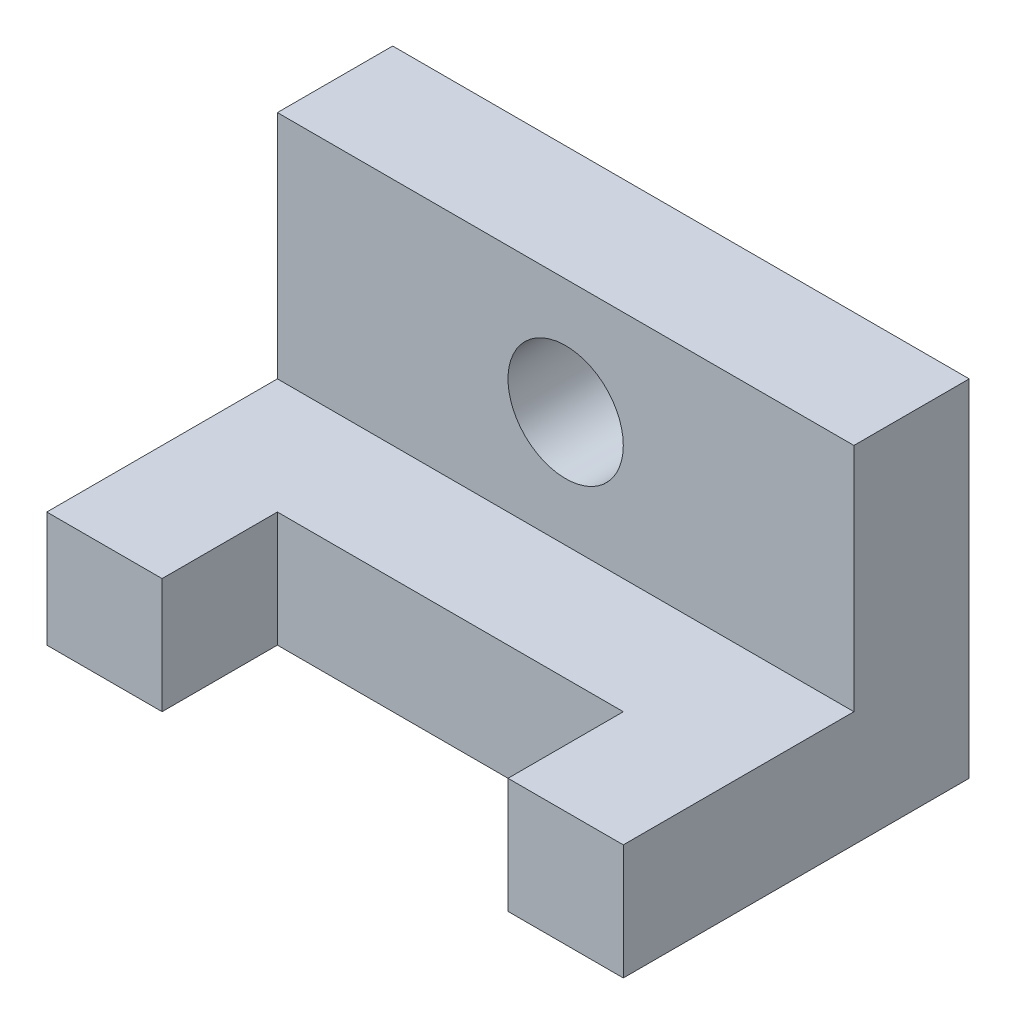
ISO-10303-21;
HEADER;
FILE_DESCRIPTION(('STEP AP214'),'2;1');
FILE_NAME('part.step','',(''),(''),'','','');
FILE_SCHEMA(('AUTOMOTIVE_DESIGN { 1 0 10303 214 1 1 1 1 }'));
ENDSEC;
DATA;
#1=APPLICATION_CONTEXT('core data for automotive mechanical design processes');
#2=APPLICATION_PROTOCOL_DEFINITION('international standard','automotive_design',2000,#1);
#3=PRODUCT_CONTEXT('',#1,'mechanical');
#4=PRODUCT('Part','Part','',(#3));
#5=PRODUCT_RELATED_PRODUCT_CATEGORY('part','',(#4));
#6=PRODUCT_DEFINITION_FORMATION('','',#4);
#7=PRODUCT_DEFINITION_CONTEXT('part definition',#1,'design');
#8=PRODUCT_DEFINITION('design','',#6,#7);
#9=PRODUCT_DEFINITION_SHAPE('','',#8);
#10=(LENGTH_UNIT() NAMED_UNIT(*) SI_UNIT(.MILLI.,.METRE.));
#11=(NAMED_UNIT(*) PLANE_ANGLE_UNIT() SI_UNIT($,.RADIAN.));
#12=(NAMED_UNIT(*) SI_UNIT($,.STERADIAN.) SOLID_ANGLE_UNIT());
#13=UNCERTAINTY_MEASURE_WITH_UNIT(LENGTH_MEASURE(1.E-05),#10,'distance_accuracy_value','');
#14=(GEOMETRIC_REPRESENTATION_CONTEXT(3) GLOBAL_UNCERTAINTY_ASSIGNED_CONTEXT((#13)) GLOBAL_UNIT_ASSIGNED_CONTEXT((#10,
#11,#12)) REPRESENTATION_CONTEXT('',''));
#15=CARTESIAN_POINT('',(0.,0.,0.));
#16=DIRECTION('',(0.,0.,1.));
#17=DIRECTION('',(1.,0.,0.));
#18=AXIS2_PLACEMENT_3D('',#15,#16,#17);
#19=CARTESIAN_POINT('',(80.,20.,0.));
#20=DIRECTION('',(-1.,0.,0.));
#21=DIRECTION('',(0.,0.,1.));
#22=AXIS2_PLACEMENT_3D('',#19,#20,#21);
#23=PLANE('',#22);
#24=DIRECTION('',(0.,0.,-1.));
#25=VECTOR('',#24,1.);
#26=CARTESIAN_POINT('',(80.,0.,0.));
#27=LINE('',#26,#25);
#28=CARTESIAN_POINT('',(80.,0.,0.));
#29=VERTEX_POINT('',#28);
#30=CARTESIAN_POINT('',(80.,0.,-20.));
#31=VERTEX_POINT('',#30);
#32=EDGE_CURVE('E129',#29,#31,#27,.T.);
#33=ORIENTED_EDGE('',*,*,#32,.F.);
#34=DIRECTION('',(0.,-1.,0.));
#35=VECTOR('',#34,1.);
#36=CARTESIAN_POINT('',(80.,20.,0.));
#37=LINE('',#36,#35);
#38=CARTESIAN_POINT('',(80.,20.,0.));
#39=VERTEX_POINT('',#38);
#40=EDGE_CURVE('E11',#39,#29,#37,.T.);
#41=ORIENTED_EDGE('',*,*,#40,.F.);
#42=DIRECTION('',(0.,0.,-1.));
#43=VECTOR('',#42,1.);
#44=CARTESIAN_POINT('',(80.,20.,0.));
#45=LINE('',#44,#43);
#46=CARTESIAN_POINT('',(80.,20.,-20.));
#47=VERTEX_POINT('',#46);
#48=EDGE_CURVE('E144',#39,#47,#45,.T.);
#49=ORIENTED_EDGE('',*,*,#48,.T.);
#50=DIRECTION('',(0.,-1.,0.));
#51=VECTOR('',#50,1.);
#52=CARTESIAN_POINT('',(80.,20.,-20.));
#53=LINE('',#52,#51);
#54=EDGE_CURVE('E87',#47,#31,#53,.T.);
#55=ORIENTED_EDGE('',*,*,#54,.T.);
#56=EDGE_LOOP('',(#33,#41,#49,#55));
#57=FACE_BOUND('',#56,.T.);
#58=ADVANCED_FACE('F41',(#57),#23,.T.);
#59=CARTESIAN_POINT('',(0.,20.,0.));
#60=DIRECTION('',(0.,0.,-1.));
#61=DIRECTION('',(-1.,0.,0.));
#62=AXIS2_PLACEMENT_3D('',#59,#60,#61);
#63=PLANE('',#62);
#64=DIRECTION('',(1.,0.,0.));
#65=VECTOR('',#64,1.);
#66=CARTESIAN_POINT('',(0.,0.,0.));
#67=LINE('',#66,#65);
#68=CARTESIAN_POINT('',(100.,0.,0.));
#69=VERTEX_POINT('',#68);
#70=EDGE_CURVE('E132',#29,#69,#67,.T.);
#71=ORIENTED_EDGE('',*,*,#70,.T.);
#72=DIRECTION('',(0.,-1.,0.));
#73=VECTOR('',#72,1.);
#74=CARTESIAN_POINT('',(100.,20.,0.));
#75=LINE('',#74,#73);
#76=CARTESIAN_POINT('',(100.,20.,0.));
#77=VERTEX_POINT('',#76);
#78=EDGE_CURVE('E49',#77,#69,#75,.T.);
#79=ORIENTED_EDGE('',*,*,#78,.F.);
#80=DIRECTION('',(1.,0.,0.));
#81=VECTOR('',#80,1.);
#82=CARTESIAN_POINT('',(0.,20.,0.));
#83=LINE('',#82,#81);
#84=EDGE_CURVE('E115',#39,#77,#83,.T.);
#85=ORIENTED_EDGE('',*,*,#84,.F.);
#86=ORIENTED_EDGE('',*,*,#40,.T.);
#87=EDGE_LOOP('',(#71,#79,#85,#86));
#88=FACE_BOUND('',#87,.T.);
#89=ADVANCED_FACE('F234',(#88),#63,.F.);
#90=CARTESIAN_POINT('',(100.,20.,0.));
#91=DIRECTION('',(-1.,0.,0.));
#92=DIRECTION('',(0.,0.,1.));
#93=AXIS2_PLACEMENT_3D('',#90,#91,#92);
#94=PLANE('',#93);
#95=DIRECTION('',(0.,0.,-1.));
#96=VECTOR('',#95,1.);
#97=CARTESIAN_POINT('',(100.,0.,0.));
#98=LINE('',#97,#96);
#99=CARTESIAN_POINT('',(100.,0.,-60.));
#100=VERTEX_POINT('',#99);
#101=EDGE_CURVE('E135',#69,#100,#98,.T.);
#102=ORIENTED_EDGE('',*,*,#101,.T.);
#103=DIRECTION('',(0.,-1.,0.));
#104=VECTOR('',#103,1.);
#105=CARTESIAN_POINT('',(100.,60.,-60.));
#106=LINE('',#105,#104);
#107=CARTESIAN_POINT('',(100.,60.,-60.));
#108=VERTEX_POINT('',#107);
#109=EDGE_CURVE('E187',#108,#100,#106,.T.);
#110=ORIENTED_EDGE('',*,*,#109,.F.);
#111=DIRECTION('',(0.,0.,-1.));
#112=VECTOR('',#111,1.);
#113=CARTESIAN_POINT('',(100.,60.,0.));
#114=LINE('',#113,#112);
#115=CARTESIAN_POINT('',(100.,60.,-40.));
#116=VERTEX_POINT('',#115);
#117=EDGE_CURVE('E211',#116,#108,#114,.T.);
#118=ORIENTED_EDGE('',*,*,#117,.F.);
#119=DIRECTION('',(0.,-1.,0.));
#120=VECTOR('',#119,1.);
#121=CARTESIAN_POINT('',(100.,60.,-40.));
#122=LINE('',#121,#120);
#123=CARTESIAN_POINT('',(100.,20.,-40.));
#124=VERTEX_POINT('',#123);
#125=EDGE_CURVE('E189',#116,#124,#122,.T.);
#126=ORIENTED_EDGE('',*,*,#125,.T.);
#127=DIRECTION('',(0.,0.,-1.));
#128=VECTOR('',#127,1.);
#129=CARTESIAN_POINT('',(100.,20.,0.));
#130=LINE('',#129,#128);
#131=EDGE_CURVE('E158',#77,#124,#130,.T.);
#132=ORIENTED_EDGE('',*,*,#131,.F.);
#133=ORIENTED_EDGE('',*,*,#78,.T.);
#134=EDGE_LOOP('',(#102,#110,#118,#126,#132,#133));
#135=FACE_BOUND('',#134,.T.);
#136=ADVANCED_FACE('F152',(#135),#94,.F.);
#137=CARTESIAN_POINT('',(0.,20.,0.));
#138=DIRECTION('',(-1.,0.,0.));
#139=DIRECTION('',(0.,0.,1.));
#140=AXIS2_PLACEMENT_3D('',#137,#138,#139);
#141=PLANE('',#140);
#142=DIRECTION('',(0.,0.,-1.));
#143=VECTOR('',#142,1.);
#144=CARTESIAN_POINT('',(0.,0.,0.));
#145=LINE('',#144,#143);
#146=CARTESIAN_POINT('',(0.,0.,0.));
#147=VERTEX_POINT('',#146);
#148=CARTESIAN_POINT('',(0.,0.,-60.));
#149=VERTEX_POINT('',#148);
#150=EDGE_CURVE('E138',#147,#149,#145,.T.);
#151=ORIENTED_EDGE('',*,*,#150,.F.);
#152=DIRECTION('',(0.,-1.,0.));
#153=VECTOR('',#152,1.);
#154=CARTESIAN_POINT('',(0.,20.,0.));
#155=LINE('',#154,#153);
#156=CARTESIAN_POINT('',(0.,20.,0.));
#157=VERTEX_POINT('',#156);
#158=EDGE_CURVE('E120',#157,#147,#155,.T.);
#159=ORIENTED_EDGE('',*,*,#158,.F.);
#160=DIRECTION('',(0.,0.,-1.));
#161=VECTOR('',#160,1.);
#162=CARTESIAN_POINT('',(0.,20.,0.));
#163=LINE('',#162,#161);
#164=CARTESIAN_POINT('',(0.,20.,-40.));
#165=VERTEX_POINT('',#164);
#166=EDGE_CURVE('E112',#157,#165,#163,.T.);
#167=ORIENTED_EDGE('',*,*,#166,.T.);
#168=DIRECTION('',(0.,-1.,0.));
#169=VECTOR('',#168,1.);
#170=CARTESIAN_POINT('',(0.,60.,-40.));
#171=LINE('',#170,#169);
#172=CARTESIAN_POINT('',(0.,60.,-40.));
#173=VERTEX_POINT('',#172);
#174=EDGE_CURVE('E133',#173,#165,#171,.T.);
#175=ORIENTED_EDGE('',*,*,#174,.F.);
#176=DIRECTION('',(0.,0.,-1.));
#177=VECTOR('',#176,1.);
#178=CARTESIAN_POINT('',(0.,60.,0.));
#179=LINE('',#178,#177);
#180=CARTESIAN_POINT('',(0.,60.,-60.));
#181=VERTEX_POINT('',#180);
#182=EDGE_CURVE('E172',#173,#181,#179,.T.);
#183=ORIENTED_EDGE('',*,*,#182,.T.);
#184=DIRECTION('',(0.,-1.,0.));
#185=VECTOR('',#184,1.);
#186=CARTESIAN_POINT('',(0.,60.,-60.));
#187=LINE('',#186,#185);
#188=EDGE_CURVE('E185',#181,#149,#187,.T.);
#189=ORIENTED_EDGE('',*,*,#188,.T.);
#190=EDGE_LOOP('',(#151,#159,#167,#175,#183,#189));
#191=FACE_BOUND('',#190,.T.);
#192=ADVANCED_FACE('F200',(#191),#141,.T.);
#193=CARTESIAN_POINT('',(20.,0.,0.));
#194=VERTEX_POINT('',#193);
#195=EDGE_CURVE('E119',#147,#194,#67,.T.);
#196=ORIENTED_EDGE('',*,*,#195,.T.);
#197=DIRECTION('',(0.,-1.,0.));
#198=VECTOR('',#197,1.);
#199=CARTESIAN_POINT('',(20.,20.,0.));
#200=LINE('',#199,#198);
#201=CARTESIAN_POINT('',(20.,20.,0.));
#202=VERTEX_POINT('',#201);
#203=EDGE_CURVE('E116',#202,#194,#200,.T.);
#204=ORIENTED_EDGE('',*,*,#203,.F.);
#205=EDGE_CURVE('E106',#157,#202,#83,.T.);
#206=ORIENTED_EDGE('',*,*,#205,.F.);
#207=ORIENTED_EDGE('',*,*,#158,.T.);
#208=EDGE_LOOP('',(#196,#204,#206,#207));
#209=FACE_BOUND('',#208,.T.);
#210=ADVANCED_FACE('F117',(#209),#63,.F.);
#211=CARTESIAN_POINT('',(20.,20.,0.));
#212=DIRECTION('',(-1.,0.,0.));
#213=DIRECTION('',(0.,0.,1.));
#214=AXIS2_PLACEMENT_3D('',#211,#212,#213);
#215=PLANE('',#214);
#216=DIRECTION('',(0.,0.,-1.));
#217=VECTOR('',#216,1.);
#218=CARTESIAN_POINT('',(20.,0.,0.));
#219=LINE('',#218,#217);
#220=CARTESIAN_POINT('',(20.,0.,-20.));
#221=VERTEX_POINT('',#220);
#222=EDGE_CURVE('E80',#194,#221,#219,.T.);
#223=ORIENTED_EDGE('',*,*,#222,.T.);
#224=DIRECTION('',(0.,-1.,0.));
#225=VECTOR('',#224,1.);
#226=CARTESIAN_POINT('',(20.,20.,-20.));
#227=LINE('',#226,#225);
#228=CARTESIAN_POINT('',(20.,20.,-20.));
#229=VERTEX_POINT('',#228);
#230=EDGE_CURVE('E121',#229,#221,#227,.T.);
#231=ORIENTED_EDGE('',*,*,#230,.F.);
#232=DIRECTION('',(0.,0.,-1.));
#233=VECTOR('',#232,1.);
#234=CARTESIAN_POINT('',(20.,20.,0.));
#235=LINE('',#234,#233);
#236=EDGE_CURVE('E110',#202,#229,#235,.T.);
#237=ORIENTED_EDGE('',*,*,#236,.F.);
#238=ORIENTED_EDGE('',*,*,#203,.T.);
#239=EDGE_LOOP('',(#223,#231,#237,#238));
#240=FACE_BOUND('',#239,.T.);
#241=ADVANCED_FACE('F123',(#240),#215,.F.);
#242=CARTESIAN_POINT('',(0.,20.,-20.));
#243=DIRECTION('',(0.,0.,-1.));
#244=DIRECTION('',(-1.,0.,0.));
#245=AXIS2_PLACEMENT_3D('',#242,#243,#244);
#246=PLANE('',#245);
#247=DIRECTION('',(1.,0.,0.));
#248=VECTOR('',#247,1.);
#249=CARTESIAN_POINT('',(0.,0.,-20.));
#250=LINE('',#249,#248);
#251=EDGE_CURVE('E142',#221,#31,#250,.T.);
#252=ORIENTED_EDGE('',*,*,#251,.T.);
#253=ORIENTED_EDGE('',*,*,#54,.F.);
#254=DIRECTION('',(1.,0.,0.));
#255=VECTOR('',#254,1.);
#256=CARTESIAN_POINT('',(0.,20.,-20.));
#257=LINE('',#256,#255);
#258=EDGE_CURVE('E57',#229,#47,#257,.T.);
#259=ORIENTED_EDGE('',*,*,#258,.F.);
#260=ORIENTED_EDGE('',*,*,#230,.T.);
#261=EDGE_LOOP('',(#252,#253,#259,#260));
#262=FACE_BOUND('',#261,.T.);
#263=ADVANCED_FACE('F241',(#262),#246,.F.);
#264=CARTESIAN_POINT('',(0.,20.,0.));
#265=DIRECTION('',(0.,1.,0.));
#266=DIRECTION('',(0.,0.,1.));
#267=AXIS2_PLACEMENT_3D('',#264,#265,#266);
#268=PLANE('',#267);
#269=ORIENTED_EDGE('',*,*,#48,.F.);
#270=ORIENTED_EDGE('',*,*,#84,.T.);
#271=ORIENTED_EDGE('',*,*,#131,.T.);
#272=DIRECTION('',(1.,0.,0.));
#273=VECTOR('',#272,1.);
#274=CARTESIAN_POINT('',(0.,20.,-40.));
#275=LINE('',#274,#273);
#276=EDGE_CURVE('E194',#165,#124,#275,.T.);
#277=ORIENTED_EDGE('',*,*,#276,.F.);
#278=ORIENTED_EDGE('',*,*,#166,.F.);
#279=ORIENTED_EDGE('',*,*,#205,.T.);
#280=ORIENTED_EDGE('',*,*,#236,.T.);
#281=ORIENTED_EDGE('',*,*,#258,.T.);
#282=EDGE_LOOP('',(#269,#270,#271,#277,#278,#279,#280,#281));
#283=FACE_BOUND('',#282,.T.);
#284=ADVANCED_FACE('F108',(#283),#268,.T.);
#285=CARTESIAN_POINT('',(0.,0.,0.));
#286=DIRECTION('',(0.,1.,0.));
#287=DIRECTION('',(0.,0.,1.));
#288=AXIS2_PLACEMENT_3D('',#285,#286,#287);
#289=PLANE('',#288);
#290=ORIENTED_EDGE('',*,*,#32,.T.);
#291=ORIENTED_EDGE('',*,*,#251,.F.);
#292=ORIENTED_EDGE('',*,*,#222,.F.);
#293=ORIENTED_EDGE('',*,*,#195,.F.);
#294=ORIENTED_EDGE('',*,*,#150,.T.);
#295=DIRECTION('',(1.,0.,0.));
#296=VECTOR('',#295,1.);
#297=CARTESIAN_POINT('',(0.,0.,-60.));
#298=LINE('',#297,#296);
#299=EDGE_CURVE('E165',#149,#100,#298,.T.);
#300=ORIENTED_EDGE('',*,*,#299,.T.);
#301=ORIENTED_EDGE('',*,*,#101,.F.);
#302=ORIENTED_EDGE('',*,*,#70,.F.);
#303=EDGE_LOOP('',(#290,#291,#292,#293,#294,#300,#301,#302));
#304=FACE_BOUND('',#303,.T.);
#305=ADVANCED_FACE('F163',(#304),#289,.F.);
#306=CARTESIAN_POINT('',(0.,60.,-40.));
#307=DIRECTION('',(0.,0.,-1.));
#308=DIRECTION('',(-1.,0.,0.));
#309=AXIS2_PLACEMENT_3D('',#306,#307,#308);
#310=PLANE('',#309);
#311=CARTESIAN_POINT('',(50.,40.,-40.));
#312=DIRECTION('',(0.,0.,1.));
#313=DIRECTION('',(1.,0.,0.));
#314=AXIS2_PLACEMENT_3D('',#311,#312,#313);
#315=CIRCLE('',#314,10.);
#316=CARTESIAN_POINT('',(60.,40.,-40.));
#317=VERTEX_POINT('',#316);
#318=EDGE_CURVE('E179',#317,#317,#315,.T.);
#319=ORIENTED_EDGE('',*,*,#318,.F.);
#320=EDGE_LOOP('',(#319));
#321=FACE_BOUND('',#320,.T.);
#322=ORIENTED_EDGE('',*,*,#174,.T.);
#323=ORIENTED_EDGE('',*,*,#276,.T.);
#324=ORIENTED_EDGE('',*,*,#125,.F.);
#325=DIRECTION('',(1.,0.,0.));
#326=VECTOR('',#325,1.);
#327=CARTESIAN_POINT('',(0.,60.,-40.));
#328=LINE('',#327,#326);
#329=EDGE_CURVE('E176',#173,#116,#328,.T.);
#330=ORIENTED_EDGE('',*,*,#329,.F.);
#331=EDGE_LOOP('',(#322,#323,#324,#330));
#332=FACE_BOUND('',#331,.T.);
#333=ADVANCED_FACE('F203',(#321,#332),#310,.F.);
#334=CARTESIAN_POINT('',(0.,60.,-60.));
#335=DIRECTION('',(0.,0.,-1.));
#336=DIRECTION('',(-1.,0.,0.));
#337=AXIS2_PLACEMENT_3D('',#334,#335,#336);
#338=PLANE('',#337);
#339=CARTESIAN_POINT('',(50.,40.,-60.));
#340=DIRECTION('',(0.,0.,1.));
#341=DIRECTION('',(1.,0.,0.));
#342=AXIS2_PLACEMENT_3D('',#339,#340,#341);
#343=CIRCLE('',#342,10.);
#344=CARTESIAN_POINT('',(60.,40.,-60.));
#345=VERTEX_POINT('',#344);
#346=EDGE_CURVE('E173',#345,#345,#343,.T.);
#347=ORIENTED_EDGE('',*,*,#346,.T.);
#348=EDGE_LOOP('',(#347));
#349=FACE_BOUND('',#348,.T.);
#350=ORIENTED_EDGE('',*,*,#299,.F.);
#351=ORIENTED_EDGE('',*,*,#188,.F.);
#352=DIRECTION('',(1.,0.,0.));
#353=VECTOR('',#352,1.);
#354=CARTESIAN_POINT('',(0.,60.,-60.));
#355=LINE('',#354,#353);
#356=EDGE_CURVE('E183',#181,#108,#355,.T.);
#357=ORIENTED_EDGE('',*,*,#356,.T.);
#358=ORIENTED_EDGE('',*,*,#109,.T.);
#359=EDGE_LOOP('',(#350,#351,#357,#358));
#360=FACE_BOUND('',#359,.T.);
#361=ADVANCED_FACE('F221',(#349,#360),#338,.T.);
#362=CARTESIAN_POINT('',(0.,60.,0.));
#363=DIRECTION('',(0.,1.,0.));
#364=DIRECTION('',(0.,0.,1.));
#365=AXIS2_PLACEMENT_3D('',#362,#363,#364);
#366=PLANE('',#365);
#367=ORIENTED_EDGE('',*,*,#182,.F.);
#368=ORIENTED_EDGE('',*,*,#329,.T.);
#369=ORIENTED_EDGE('',*,*,#117,.T.);
#370=ORIENTED_EDGE('',*,*,#356,.F.);
#371=EDGE_LOOP('',(#367,#368,#369,#370));
#372=FACE_BOUND('',#371,.T.);
#373=ADVANCED_FACE('F214',(#372),#366,.T.);
#374=CARTESIAN_POINT('',(50.,40.,-60.));
#375=DIRECTION('',(0.,0.,1.));
#376=DIRECTION('',(1.,0.,0.));
#377=AXIS2_PLACEMENT_3D('',#374,#375,#376);
#378=CYLINDRICAL_SURFACE('',#377,10.);
#379=ORIENTED_EDGE('',*,*,#346,.F.);
#380=EDGE_LOOP('',(#379));
#381=FACE_BOUND('',#380,.T.);
#382=ORIENTED_EDGE('',*,*,#318,.T.);
#383=EDGE_LOOP('',(#382));
#384=FACE_BOUND('',#383,.T.);
#385=ADVANCED_FACE('F229',(#381,#384),#378,.F.);
#386=CLOSED_SHELL('',(#58,#89,#136,#192,#210,#241,#263,#284,#305,#333,#361,#373,#385));
#387=MANIFOLD_SOLID_BREP('B2',#386);
#388=ADVANCED_BREP_SHAPE_REPRESENTATION('',(#18,#387),#14);
#389=SHAPE_DEFINITION_REPRESENTATION(#9,#388);
ENDSEC;
END-ISO-10303-21;
